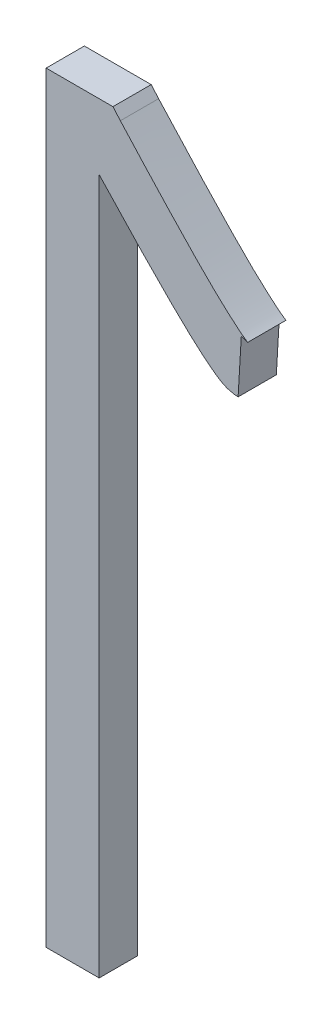
ISO-10303-21;
HEADER;
FILE_DESCRIPTION(('STEP AP214'),'2;1');
FILE_NAME('part.step','',(''),(''),'','','');
FILE_SCHEMA(('AUTOMOTIVE_DESIGN { 1 0 10303 214 1 1 1 1 }'));
ENDSEC;
DATA;
#1=APPLICATION_CONTEXT('core data for automotive mechanical design processes');
#2=APPLICATION_PROTOCOL_DEFINITION('international standard','automotive_design',2000,#1);
#3=PRODUCT_CONTEXT('',#1,'mechanical');
#4=PRODUCT('Part','Part','',(#3));
#5=PRODUCT_RELATED_PRODUCT_CATEGORY('part','',(#4));
#6=PRODUCT_DEFINITION_FORMATION('','',#4);
#7=PRODUCT_DEFINITION_CONTEXT('part definition',#1,'design');
#8=PRODUCT_DEFINITION('design','',#6,#7);
#9=PRODUCT_DEFINITION_SHAPE('','',#8);
#10=(LENGTH_UNIT() NAMED_UNIT(*) SI_UNIT(.MILLI.,.METRE.));
#11=(NAMED_UNIT(*) PLANE_ANGLE_UNIT() SI_UNIT($,.RADIAN.));
#12=(NAMED_UNIT(*) SI_UNIT($,.STERADIAN.) SOLID_ANGLE_UNIT());
#13=UNCERTAINTY_MEASURE_WITH_UNIT(LENGTH_MEASURE(1.E-05),#10,'distance_accuracy_value','');
#14=(GEOMETRIC_REPRESENTATION_CONTEXT(3) GLOBAL_UNCERTAINTY_ASSIGNED_CONTEXT((#13)) GLOBAL_UNIT_ASSIGNED_CONTEXT((#10,
#11,#12)) REPRESENTATION_CONTEXT('',''));
#15=CARTESIAN_POINT('',(0.,0.,0.));
#16=DIRECTION('',(0.,0.,1.));
#17=DIRECTION('',(1.,0.,0.));
#18=AXIS2_PLACEMENT_3D('',#15,#16,#17);
#19=CARTESIAN_POINT('',(68.447564492184,63.9182003094345,-39.));
#20=DIRECTION('',(-4.75972443378902E-11,-4.42735276274626E-11,-1.));
#21=DIRECTION('',(-1.,0.,4.75972443378902E-11));
#22=AXIS2_PLACEMENT_3D('',#19,#20,#21);
#23=PLANE('',#22);
#24=DIRECTION('',(-1.,0.,4.75972443378902E-11));
#25=VECTOR('',#24,1.);
#26=CARTESIAN_POINT('',(68.447564492184,62.2764032970511,-38.9999999999273));
#27=LINE('',#26,#25);
#28=CARTESIAN_POINT('',(68.2779789419903,62.2764032970511,-38.9999999999731));
#29=VERTEX_POINT('',#28);
#30=CARTESIAN_POINT('',(68.1392826867903,62.2764032970511,-38.9999999999709));
#31=VERTEX_POINT('',#30);
#32=EDGE_CURVE('E154',#29,#31,#27,.T.);
#33=ORIENTED_EDGE('',*,*,#32,.F.);
#34=DIRECTION('',(0.,1.,0.));
#35=VECTOR('',#34,1.);
#36=CARTESIAN_POINT('',(68.2779789419903,62.2764032970511,-39.));
#37=LINE('',#36,#35);
#38=CARTESIAN_POINT('',(68.2779789419903,64.0960981652811,-39.));
#39=VERTEX_POINT('',#38);
#40=EDGE_CURVE('E146',#29,#39,#37,.T.);
#41=ORIENTED_EDGE('',*,*,#40,.T.);
#42=CARTESIAN_POINT('',(68.2779789419903,64.0960981652811,-39.0000000000001));
#43=CARTESIAN_POINT('',(68.3006555803954,64.0717416984526,-39.));
#44=CARTESIAN_POINT('',(68.323361418548,64.0474068496181,-38.9999999999999));
#45=CARTESIAN_POINT('',(68.3691170207775,63.9989135358869,-38.9999999999998));
#46=CARTESIAN_POINT('',(68.3921676635081,63.9747559025107,-38.9999999999999));
#47=CARTESIAN_POINT('',(68.4319952873825,63.9338523174141,-39.0000000000002));
#48=CARTESIAN_POINT('',(68.448652051331,63.9169895837439,-39.0000000000005));
#49=CARTESIAN_POINT('',(68.4823322613997,63.8836942824924,-38.9999999999997));
#50=CARTESIAN_POINT('',(68.4993549233173,63.8672609352874,-38.9999999999986));
#51=CARTESIAN_POINT('',(68.5253676463016,63.8432865930499,-39.0000000000002));
#52=CARTESIAN_POINT('',(68.5340771251958,63.8354423767731,-39.0000000000013));
#53=CARTESIAN_POINT('',(68.5518641100801,63.820105391124,-38.9999999999998));
#54=CARTESIAN_POINT('',(68.5609428331864,63.8126139954323,-38.9999999999972));
#55=CARTESIAN_POINT('',(68.573023435901,63.8033615870462,-38.9999999999997));
#56=CARTESIAN_POINT('',(68.575788159778,63.8012905192992,-39.0000000000007));
#57=CARTESIAN_POINT('',(68.5813652496185,63.7972140263459,-39.0000000000013));
#58=CARTESIAN_POINT('',(68.5841776046496,63.7952085863784,-39.0000000000009));
#59=CARTESIAN_POINT('',(68.5898866851449,63.7913472296511,-39.0000000000013));
#60=CARTESIAN_POINT('',(68.5927829863049,63.7894906954745,-39.0000000000021));
#61=CARTESIAN_POINT('',(68.5986999189575,63.7860002510019,-39.0000000000005));
#62=CARTESIAN_POINT('',(68.601720204891,63.7843657702789,-38.9999999999981));
#63=CARTESIAN_POINT('',(68.6070280748129,63.7818721562172,-38.9999999999988));
#64=CARTESIAN_POINT('',(68.6092733955999,63.7809257580502,-39.0000000000005));
#65=CARTESIAN_POINT('',(68.6138585396111,63.7792886587211,-39.0000000000029));
#66=CARTESIAN_POINT('',(68.6161985001896,63.7785983451566,-39.0000000000037));
#67=CARTESIAN_POINT('',(68.6209112388837,63.7773603238648,-39.0000000000002));
#68=CARTESIAN_POINT('',(68.6232840052924,63.7768125665822,-38.9999999999961));
#69=CARTESIAN_POINT('',(68.6280474213865,63.775801218121,-39.0000000000083));
#70=CARTESIAN_POINT('',(68.6304380562402,63.775337563798,-39.0000000000247));
#71=CARTESIAN_POINT('',(68.6342581603601,63.7747844344083,-39.0000000000188));
#72=CARTESIAN_POINT('',(68.635675922297,63.7746195165295,-39.0000000000097));
#73=CARTESIAN_POINT('',(68.6385162673154,63.7743905422371,-38.9999999999957));
#74=CARTESIAN_POINT('',(68.6399388336155,63.7743262710002,-38.9999999999908));
#75=CARTESIAN_POINT('',(68.6413631305903,63.7743228532211,-38.9999999999972));
#76=B_SPLINE_CURVE_WITH_KNOTS('',3,(#42,#43,#44,#45,#46,#47,#48,#49,#50,#51,#52,#53,#54,#55,#56,
#57,#58,#59,#60,#61,#62,#63,#64,#65,#66,#67,#68,#69,#70,#71,#72,#73,#74,#75),.UNSPECIFIED.,.F.,
.F.,(4,2,2,2,2,2,2,2,2,2,2,2,2,2,2,2,4),(0.,0.0998428695418381,0.200010597139852,
0.271115291433883,0.342080370866229,0.377240330425396,0.412527452680904,0.422890123262118,
0.433250446791859,0.44356531528265,0.453853163834976,0.461150074505124,0.468457984804843,
0.4757633513255,0.4830632100746,0.487341754579303,0.491611154323266),.UNSPECIFIED.);
#77=CARTESIAN_POINT('',(68.6413631305874,63.7743228532213,-38.9999999999993));
#78=VERTEX_POINT('',#77);
#79=EDGE_CURVE('E221',#39,#78,#76,.T.);
#80=ORIENTED_EDGE('',*,*,#79,.T.);
#81=DIRECTION('',(-0.0587220219514129,-0.998274373174999,0.));
#82=VECTOR('',#81,1.);
#83=CARTESIAN_POINT('',(68.6413631305786,63.7743228532218,-39.));
#84=LINE('',#83,#82);
#85=CARTESIAN_POINT('',(68.6496849058937,63.9157930335311,-39.));
#86=VERTEX_POINT('',#85);
#87=EDGE_CURVE('E160',#78,#86,#84,.F.);
#88=ORIENTED_EDGE('',*,*,#87,.T.);
#89=DIRECTION('',(-0.948683298050771,0.316227766016067,0.));
#90=VECTOR('',#89,1.);
#91=CARTESIAN_POINT('',(68.6496849059003,63.9157930335511,-39.));
#92=LINE('',#91,#90);
#93=CARTESIAN_POINT('',(68.6663284565903,63.9102451833211,-39.000000000005));
#94=VERTEX_POINT('',#93);
#95=EDGE_CURVE('E95',#86,#94,#92,.F.);
#96=ORIENTED_EDGE('',*,*,#95,.T.);
#97=CARTESIAN_POINT('',(68.6663284565903,63.9102451833211,-39.0000000000101));
#98=CARTESIAN_POINT('',(68.6631666264046,63.912263360773,-39.00000000001));
#99=CARTESIAN_POINT('',(68.6600817551967,63.9143937950362,-39.0000000000099));
#100=CARTESIAN_POINT('',(68.6540328520289,63.9188129149278,-39.0000000000099));
#101=CARTESIAN_POINT('',(68.6510686683829,63.9211013915071,-39.0000000000098));
#102=CARTESIAN_POINT('',(68.6452220310909,63.9257743150047,-39.0000000000097));
#103=CARTESIAN_POINT('',(68.6423395232721,63.9281586956474,-39.0000000000097));
#104=CARTESIAN_POINT('',(68.6366031990929,63.9329636284872,-39.0000000000096));
#105=CARTESIAN_POINT('',(68.6337493934814,63.9353841934491,-39.0000000000096));
#106=CARTESIAN_POINT('',(68.6252360298289,63.9426779778371,-39.0000000000096));
#107=CARTESIAN_POINT('',(68.6196123876417,63.9475932755509,-39.0000000000096));
#108=CARTESIAN_POINT('',(68.6084654669413,63.9575390878733,-39.0000000000093));
#109=CARTESIAN_POINT('',(68.6029422149863,63.9625696321971,-39.0000000000089));
#110=CARTESIAN_POINT('',(68.5865321982889,63.9777937598469,-39.0000000000102));
#111=CARTESIAN_POINT('',(68.5757846698538,63.9881375052907,-39.0000000000144));
#112=CARTESIAN_POINT('',(68.5545666351993,64.0091023198122,-39.0000000000039));
#113=CARTESIAN_POINT('',(68.5440961270125,64.0197233869193,-38.9999999999891));
#114=CARTESIAN_POINT('',(68.525158731474,64.0391993463719,-38.9999999999924));
#115=CARTESIAN_POINT('',(68.5166678421672,64.0480310542963,-39.000000000005));
#116=CARTESIAN_POINT('',(68.4997370163756,64.0657428752237,-39.000000000013));
#117=CARTESIAN_POINT('',(68.4912970790388,64.0746229874126,-39.0000000000083));
#118=CARTESIAN_POINT('',(68.466048604975,64.1013504543014,-39.0000000000104));
#119=CARTESIAN_POINT('',(68.4493214066294,64.1192746076717,-39.0000000000333));
#120=CARTESIAN_POINT('',(68.4243164716795,64.1462482850813,-39.0000000000234));
#121=CARTESIAN_POINT('',(68.4159937713975,64.1552563073521,-39.0000000000127));
#122=CARTESIAN_POINT('',(68.3994027484361,64.1733224120815,-39.0000000000053));
#123=CARTESIAN_POINT('',(68.391134426124,64.1823804948773,-39.0000000000084));
#124=CARTESIAN_POINT('',(68.3787384737149,64.1959669617419,-39.0000000000093));
#125=CARTESIAN_POINT('',(68.3746092161347,64.2004938773921,-39.000000000009));
#126=CARTESIAN_POINT('',(68.3663361811171,64.2095343212935,-39.0000000000091));
#127=CARTESIAN_POINT('',(68.3621924037962,64.2140478496517,-39.0000000000095));
#128=CARTESIAN_POINT('',(68.353916670893,64.2230859998577,-39.0000000000086));
#129=CARTESIAN_POINT('',(68.3497847154686,64.2276106218523,-39.0000000000073));
#130=CARTESIAN_POINT('',(68.3415723988403,64.236706526035,-39.0000000000108));
#131=CARTESIAN_POINT('',(68.3374920389764,64.2412778094293,-39.0000000000156));
#132=CARTESIAN_POINT('',(68.3334574440903,64.2458901209011,-39.0000000000272));
#133=B_SPLINE_CURVE_WITH_KNOTS('',3,(#97,#98,#99,#100,#101,#102,#103,#104,#105,#106,#107,#108,
#109,#110,#111,#112,#113,#114,#115,#116,#117,#118,#119,#120,#121,#122,#123,#124,#125,#126,#127,
#128,#129,#130,#131,#132),.UNSPECIFIED.,.F.,.F.,(4,2,2,2,2,2,2,2,2,2,2,2,2,2,2,2,2,4),(0.,
0.01124434568953,0.0224740928101984,0.0336962084844143,0.0449223810029845,0.0673275766513838,
0.0897386157500265,0.134479554821638,0.179220176066574,0.215973811907436,0.252726831512014,
0.326276003969627,0.363068657346945,0.399861558912346,0.41824342005346,0.436625133971727,
0.455007092306981,0.473389526996567),.UNSPECIFIED.);
#134=CARTESIAN_POINT('',(68.3334574440799,64.245890120892,-39.0000000000113));
#135=VERTEX_POINT('',#134);
#136=EDGE_CURVE('E24',#94,#135,#133,.T.);
#137=ORIENTED_EDGE('',*,*,#136,.T.);
#138=DIRECTION('',(0.658504607868102,-0.752576694707242,0.));
#139=VECTOR('',#138,1.);
#140=CARTESIAN_POINT('',(68.3334574440485,64.2458901208646,-39.));
#141=LINE('',#140,#139);
#142=CARTESIAN_POINT('',(68.3140399682903,64.2680815217311,-39.));
#143=VERTEX_POINT('',#142);
#144=EDGE_CURVE('E98',#135,#143,#141,.F.);
#145=ORIENTED_EDGE('',*,*,#144,.T.);
#146=DIRECTION('',(1.,0.,0.));
#147=VECTOR('',#146,1.);
#148=CARTESIAN_POINT('',(68.3140399682903,64.2680815217311,-39.));
#149=LINE('',#148,#147);
#150=CARTESIAN_POINT('',(68.1392826867903,64.2680815217311,-39.));
#151=VERTEX_POINT('',#150);
#152=EDGE_CURVE('E133',#143,#151,#149,.F.);
#153=ORIENTED_EDGE('',*,*,#152,.T.);
#154=DIRECTION('',(0.,1.,0.));
#155=VECTOR('',#154,1.);
#156=CARTESIAN_POINT('',(68.1392826867903,64.2680815217311,-39.));
#157=LINE('',#156,#155);
#158=EDGE_CURVE('E151',#151,#31,#157,.F.);
#159=ORIENTED_EDGE('',*,*,#158,.T.);
#160=EDGE_LOOP('',(#33,#41,#80,#88,#96,#137,#145,#153,#159));
#161=FACE_BOUND('',#160,.T.);
#162=ADVANCED_FACE('F17',(#161),#23,.F.);
#163=CARTESIAN_POINT('',(68.1392826867903,64.2680815217311,-39.));
#164=DIRECTION('',(1.,0.,0.));
#165=DIRECTION('',(0.,0.,-1.));
#166=AXIS2_PLACEMENT_3D('',#163,#164,#165);
#167=PLANE('',#166);
#168=DIRECTION('',(0.,0.,1.));
#169=VECTOR('',#168,1.);
#170=CARTESIAN_POINT('',(68.1392826867903,62.2764032970511,-39.));
#171=LINE('',#170,#169);
#172=CARTESIAN_POINT('',(68.1392826867903,62.2764032970511,-39.0999999999126));
#173=VERTEX_POINT('',#172);
#174=EDGE_CURVE('E140',#173,#31,#171,.T.);
#175=ORIENTED_EDGE('',*,*,#174,.T.);
#176=ORIENTED_EDGE('',*,*,#158,.F.);
#177=DIRECTION('',(0.,0.,-1.));
#178=VECTOR('',#177,1.);
#179=CARTESIAN_POINT('',(68.1392826867903,64.2680815217311,-39.));
#180=LINE('',#179,#178);
#181=CARTESIAN_POINT('',(68.1392826867903,64.2680815217311,-39.1000000000008));
#182=VERTEX_POINT('',#181);
#183=EDGE_CURVE('E110',#151,#182,#180,.T.);
#184=ORIENTED_EDGE('',*,*,#183,.T.);
#185=DIRECTION('',(0.,1.,-4.42735276274626E-11));
#186=VECTOR('',#185,1.);
#187=CARTESIAN_POINT('',(68.1392826867903,63.9182003094345,-39.0999999999853));
#188=LINE('',#187,#186);
#189=EDGE_CURVE('E129',#173,#182,#188,.T.);
#190=ORIENTED_EDGE('',*,*,#189,.F.);
#191=EDGE_LOOP('',(#175,#176,#184,#190));
#192=FACE_BOUND('',#191,.T.);
#193=ADVANCED_FACE('F211',(#192),#167,.F.);
#194=CARTESIAN_POINT('',(68.3140399682903,64.2680815217311,-39.));
#195=DIRECTION('',(0.,-1.,0.));
#196=DIRECTION('',(0.,0.,-1.));
#197=AXIS2_PLACEMENT_3D('',#194,#195,#196);
#198=PLANE('',#197);
#199=ORIENTED_EDGE('',*,*,#183,.F.);
#200=ORIENTED_EDGE('',*,*,#152,.F.);
#201=DIRECTION('',(0.,0.,1.));
#202=VECTOR('',#201,1.);
#203=CARTESIAN_POINT('',(68.3140399682903,64.2680815217311,-39.));
#204=LINE('',#203,#202);
#205=CARTESIAN_POINT('',(68.3140399682903,64.2680815217311,-39.1000000000091));
#206=VERTEX_POINT('',#205);
#207=EDGE_CURVE('E104',#143,#206,#204,.F.);
#208=ORIENTED_EDGE('',*,*,#207,.T.);
#209=DIRECTION('',(-1.,0.,4.75972443378902E-11));
#210=VECTOR('',#209,1.);
#211=CARTESIAN_POINT('',(68.447564492184,64.2680815217311,-39.1000000000155));
#212=LINE('',#211,#210);
#213=EDGE_CURVE('E125',#182,#206,#212,.F.);
#214=ORIENTED_EDGE('',*,*,#213,.F.);
#215=EDGE_LOOP('',(#199,#200,#208,#214));
#216=FACE_BOUND('',#215,.T.);
#217=ADVANCED_FACE('F208',(#216),#198,.F.);
#218=CARTESIAN_POINT('',(68.3334574440485,64.2458901208646,-39.));
#219=DIRECTION('',(-0.752576694707242,-0.658504607868102,0.));
#220=DIRECTION('',(0.658504607868102,-0.752576694707242,0.));
#221=AXIS2_PLACEMENT_3D('',#218,#219,#220);
#222=PLANE('',#221);
#223=ORIENTED_EDGE('',*,*,#207,.F.);
#224=ORIENTED_EDGE('',*,*,#144,.F.);
#225=DIRECTION('',(0.,0.,-1.));
#226=VECTOR('',#225,1.);
#227=CARTESIAN_POINT('',(68.3334574440903,64.2458901209011,-39.05));
#228=LINE('',#227,#226);
#229=CARTESIAN_POINT('',(68.3334574440903,64.2458901209011,-39.1000000000159));
#230=VERTEX_POINT('',#229);
#231=EDGE_CURVE('E103',#135,#230,#228,.T.);
#232=ORIENTED_EDGE('',*,*,#231,.T.);
#233=DIRECTION('',(0.658504609285161,-0.752576693467315,1.88254896408836E-12));
#234=VECTOR('',#233,1.);
#235=CARTESIAN_POINT('',(68.3140399682903,64.2680815217311,-39.1000000000091));
#236=LINE('',#235,#234);
#237=EDGE_CURVE('E128',#206,#230,#236,.T.);
#238=ORIENTED_EDGE('',*,*,#237,.F.);
#239=EDGE_LOOP('',(#223,#224,#232,#238));
#240=FACE_BOUND('',#239,.T.);
#241=ADVANCED_FACE('F107',(#240),#222,.F.);
#242=CARTESIAN_POINT('',(68.6663284565903,63.9102451833211,-39.));
#243=CARTESIAN_POINT('',(68.6663284565903,63.9102451833211,-39.1));
#244=CARTESIAN_POINT('',(68.6623090070903,63.9128106150712,-39.));
#245=CARTESIAN_POINT('',(68.6623090070903,63.9128106150712,-39.1));
#246=CARTESIAN_POINT('',(68.6525978408903,63.9196598710911,-39.));
#247=CARTESIAN_POINT('',(68.6525978408903,63.9196598710911,-39.1));
#248=CARTESIAN_POINT('',(68.6360874510903,63.9332862315011,-39.));
#249=CARTESIAN_POINT('',(68.6360874510903,63.9332862315011,-39.1));
#250=CARTESIAN_POINT('',(68.6149255722903,63.9515757994111,-39.));
#251=CARTESIAN_POINT('',(68.6149255722903,63.9515757994111,-39.1));
#252=CARTESIAN_POINT('',(68.5902165865903,63.9741962100811,-39.));
#253=CARTESIAN_POINT('',(68.5902165865903,63.9741962100811,-39.1));
#254=CARTESIAN_POINT('',(68.5629658677903,64.0005919824511,-39.));
#255=CARTESIAN_POINT('',(68.5629658677903,64.0005919824511,-39.1));
#256=CARTESIAN_POINT('',(68.5337347365903,64.0302387905511,-39.));
#257=CARTESIAN_POINT('',(68.5337347365903,64.0302387905511,-39.1));
#258=CARTESIAN_POINT('',(68.5026423796903,64.0626383132811,-39.));
#259=CARTESIAN_POINT('',(68.5026423796903,64.0626383132811,-39.1));
#260=CARTESIAN_POINT('',(68.4698109029903,64.0973079919511,-39.));
#261=CARTESIAN_POINT('',(68.4698109029903,64.0973079919511,-39.1));
#262=CARTESIAN_POINT('',(68.4358401407903,64.1337628938011,-39.));
#263=CARTESIAN_POINT('',(68.4358401407903,64.1337628938011,-39.1));
#264=CARTESIAN_POINT('',(68.4013583721903,64.1710978473811,-39.));
#265=CARTESIAN_POINT('',(68.4013583721903,64.1710978473811,-39.1));
#266=CARTESIAN_POINT('',(68.3672479230903,64.2086364377211,-39.));
#267=CARTESIAN_POINT('',(68.3672479230903,64.2086364377211,-39.1));
#268=CARTESIAN_POINT('',(68.3444500846903,64.2333271030511,-39.));
#269=CARTESIAN_POINT('',(68.3444500846903,64.2333271030511,-39.1));
#270=CARTESIAN_POINT('',(68.3334574440903,64.2458901209011,-39.));
#271=CARTESIAN_POINT('',(68.3334574440903,64.2458901209011,-39.1));
#272=B_SPLINE_SURFACE_WITH_KNOTS('',3,1,((#242,#243),(#244,#245),(#246,#247),(#248,#249),(#250,
#251),(#252,#253),(#254,#255),(#256,#257),(#258,#259),(#260,#261),(#262,#263),(#264,#265),(#266,
#267),(#268,#269),(#270,#271)),.UNSPECIFIED.,.F.,.F.,.F.,(4,1,1,1,1,1,1,1,1,1,1,1,4),(2,2),(0.,
0.0301632298913,0.0753104703666,0.1355499087429,0.2074424892077,0.2875616665251,0.3759570962285,
0.4712749173558,0.5721374197463,0.6785504860529,0.7870597152265,0.894208704653,1.),(1.,1.1),.UNSPECIFIED.);
#273=DIRECTION('',(0.,0.,1.));
#274=VECTOR('',#273,1.);
#275=CARTESIAN_POINT('',(68.6663284565903,63.9102451833211,-39.));
#276=LINE('',#275,#274);
#277=CARTESIAN_POINT('',(68.6663284565903,63.9102451833211,-39.1000000000101));
#278=VERTEX_POINT('',#277);
#279=EDGE_CURVE('E117',#94,#278,#276,.F.);
#280=CARTESIAN_POINT('',(68.3334574440903,64.2458901209011,-39.0999999999955));
#281=CARTESIAN_POINT('',(68.3389424310075,64.2396214656324,-39.1000000000042));
#282=CARTESIAN_POINT('',(68.3445098722922,64.2334274179446,-39.1000000000078));
#283=CARTESIAN_POINT('',(68.3557150954348,64.2211030082827,-39.1000000000103));
#284=CARTESIAN_POINT('',(68.3613528769174,64.2149726459689,-39.1000000000094));
#285=CARTESIAN_POINT('',(68.3726042293612,64.2026900600058,-39.1000000000087));
#286=CARTESIAN_POINT('',(68.3782178005093,64.1965378365257,-39.100000000009));
#287=CARTESIAN_POINT('',(68.3894443113695,64.1842327006801,-39.1000000000091));
#288=CARTESIAN_POINT('',(68.3950572510789,64.1780797883116,-39.1000000000088));
#289=CARTESIAN_POINT('',(68.411952499477,64.1596324695832,-39.1000000000093));
#290=CARTESIAN_POINT('',(68.4232713403289,64.1473715542868,-39.1000000000112));
#291=CARTESIAN_POINT('',(68.4459642196372,64.1229008717801,-39.1000000000068));
#292=CARTESIAN_POINT('',(68.457338257926,64.1106911044147,-39.1000000000004));
#293=CARTESIAN_POINT('',(68.4843086593115,64.081958410916,-39.0999999999994));
#294=CARTESIAN_POINT('',(68.4999443733308,64.06547259375,-39.1000000000098));
#295=CARTESIAN_POINT('',(68.5313974530526,64.0327012943394,-39.1000000000083));
#296=CARTESIAN_POINT('',(68.5472146316537,64.0164156363185,-39.0999999999966));
#297=CARTESIAN_POINT('',(68.571441568621,63.9924084429978,-39.1000000000017));
#298=CARTESIAN_POINT('',(68.5796217909697,63.9844569460074,-39.1000000000073));
#299=CARTESIAN_POINT('',(68.5961843107614,63.9687713627149,-39.1000000000113));
#300=CARTESIAN_POINT('',(68.6045665477284,63.9610372128124,-39.1000000000097));
#301=CARTESIAN_POINT('',(68.617327005904,63.9496245242543,-39.1000000000093));
#302=CARTESIAN_POINT('',(68.6216168914208,63.945847336281,-39.1000000000095));
#303=CARTESIAN_POINT('',(68.6302515479803,63.938360163604,-39.1000000000096));
#304=CARTESIAN_POINT('',(68.634596302229,63.9346501591446,-39.1000000000096));
#305=CARTESIAN_POINT('',(68.6433586890212,63.9273007912788,-39.1000000000097));
#306=CARTESIAN_POINT('',(68.6477764031912,63.9236615185311,-39.1000000000098));
#307=CARTESIAN_POINT('',(68.6568415204799,63.9166763698502,-39.1000000000099));
#308=CARTESIAN_POINT('',(68.6614891526549,63.9133307961093,-39.10000000001));
#309=CARTESIAN_POINT('',(68.6663284565903,63.9102451833211,-39.1000000000101));
#310=B_SPLINE_CURVE_WITH_KNOTS('',3,(#280,#281,#282,#283,#284,#285,#286,#287,#288,#289,#290,
#291,#292,#293,#294,#295,#296,#297,#298,#299,#300,#301,#302,#303,#304,#305,#306,#307,#308,#309),
.UNSPECIFIED.,.F.,.F.,(4,2,2,2,2,2,2,2,2,2,2,2,2,2,4),(0.,0.0249855688329285,0.0499710043863429,
0.0749562468902699,0.0999416009353751,0.15000145686577,0.200061160724135,0.268225383486305,
0.336324714485637,0.37054563361864,0.404756432448007,0.421902679750831,0.439043800438855,
0.45620560829012,0.473384872185978),.UNSPECIFIED.);
#311=EDGE_CURVE('E114',#230,#278,#310,.T.);
#312=ORIENTED_EDGE('',*,*,#231,.F.);
#313=ORIENTED_EDGE('',*,*,#136,.F.);
#314=ORIENTED_EDGE('',*,*,#279,.T.);
#315=ORIENTED_EDGE('',*,*,#311,.F.);
#316=EDGE_LOOP('',(#312,#313,#314,#315));
#317=FACE_BOUND('',#316,.T.);
#318=ADVANCED_FACE('F112',(#317),#272,.F.);
#319=CARTESIAN_POINT('',(68.6496849059003,63.9157930335511,-39.));
#320=DIRECTION('',(0.316227766016067,0.948683298050771,0.));
#321=DIRECTION('',(-0.948683298050771,0.316227766016067,0.));
#322=AXIS2_PLACEMENT_3D('',#319,#320,#321);
#323=PLANE('',#322);
#324=ORIENTED_EDGE('',*,*,#279,.F.);
#325=ORIENTED_EDGE('',*,*,#95,.F.);
#326=DIRECTION('',(0.,0.,1.));
#327=VECTOR('',#326,1.);
#328=CARTESIAN_POINT('',(68.6496849058903,63.9157930335211,-39.));
#329=LINE('',#328,#327);
#330=CARTESIAN_POINT('',(68.6496849058903,63.9157930335211,-39.1000000000095));
#331=VERTEX_POINT('',#330);
#332=EDGE_CURVE('E162',#86,#331,#329,.F.);
#333=ORIENTED_EDGE('',*,*,#332,.T.);
#334=DIRECTION('',(-0.948683298620533,0.316227764306779,3.12458691789293E-11));
#335=VECTOR('',#334,1.);
#336=CARTESIAN_POINT('',(68.6663284565903,63.9102451833211,-39.1000000000101));
#337=LINE('',#336,#335);
#338=EDGE_CURVE('E246',#278,#331,#337,.T.);
#339=ORIENTED_EDGE('',*,*,#338,.F.);
#340=EDGE_LOOP('',(#324,#325,#333,#339));
#341=FACE_BOUND('',#340,.T.);
#342=ADVANCED_FACE('F201',(#341),#323,.F.);
#343=CARTESIAN_POINT('',(68.6413631305786,63.7743228532218,-39.));
#344=DIRECTION('',(-0.998274373174999,0.0587220219514129,0.));
#345=DIRECTION('',(-0.0587220219514129,-0.998274373174999,0.));
#346=AXIS2_PLACEMENT_3D('',#343,#344,#345);
#347=PLANE('',#346);
#348=ORIENTED_EDGE('',*,*,#332,.F.);
#349=ORIENTED_EDGE('',*,*,#87,.F.);
#350=DIRECTION('',(0.,0.,-1.));
#351=VECTOR('',#350,1.);
#352=CARTESIAN_POINT('',(68.6413631305903,63.7743228532211,-39.05));
#353=LINE('',#352,#351);
#354=CARTESIAN_POINT('',(68.6413631305903,63.7743228532211,-39.1000000000007));
#355=VERTEX_POINT('',#354);
#356=EDGE_CURVE('E148',#78,#355,#353,.T.);
#357=ORIENTED_EDGE('',*,*,#356,.T.);
#358=DIRECTION('',(-0.0587220218686165,-0.99827437317987,4.70052639353647E-11));
#359=VECTOR('',#358,1.);
#360=CARTESIAN_POINT('',(68.6496849058903,63.9157930335211,-39.1000000000095));
#361=LINE('',#360,#359);
#362=EDGE_CURVE('E180',#331,#355,#361,.T.);
#363=ORIENTED_EDGE('',*,*,#362,.F.);
#364=EDGE_LOOP('',(#348,#349,#357,#363));
#365=FACE_BOUND('',#364,.T.);
#366=ADVANCED_FACE('F198',(#365),#347,.F.);
#367=CARTESIAN_POINT('',(68.2779789419903,64.0960981652811,-39.));
#368=CARTESIAN_POINT('',(68.2779789419903,64.0960981652811,-39.1));
#369=CARTESIAN_POINT('',(68.3003547033903,64.0720426034211,-39.));
#370=CARTESIAN_POINT('',(68.3003547033903,64.0720426034211,-39.1));
#371=CARTESIAN_POINT('',(68.3418154762903,64.0276260016811,-39.));
#372=CARTESIAN_POINT('',(68.3418154762903,64.0276260016811,-39.1));
#373=CARTESIAN_POINT('',(68.3995552323903,63.9670069466511,-39.));
#374=CARTESIAN_POINT('',(68.3995552323903,63.9670069466511,-39.1));
#375=CARTESIAN_POINT('',(68.4483572632903,63.9171172222911,-39.));
#376=CARTESIAN_POINT('',(68.4483572632903,63.9171172222911,-39.1));
#377=CARTESIAN_POINT('',(68.4894922403903,63.8766587639711,-39.));
#378=CARTESIAN_POINT('',(68.4894922403903,63.8766587639711,-39.1));
#379=CARTESIAN_POINT('',(68.5240839016903,63.8441801883311,-39.));
#380=CARTESIAN_POINT('',(68.5240839016903,63.8441801883311,-39.1));
#381=CARTESIAN_POINT('',(68.5530534827903,63.8188351487611,-39.));
#382=CARTESIAN_POINT('',(68.5530534827903,63.8188351487611,-39.1));
#383=CARTESIAN_POINT('',(68.5768571835903,63.8001795507911,-39.));
#384=CARTESIAN_POINT('',(68.5768571835903,63.8001795507911,-39.1));
#385=CARTESIAN_POINT('',(68.5956422796903,63.7872310175111,-39.));
#386=CARTESIAN_POINT('',(68.5956422796903,63.7872310175111,-39.1));
#387=CARTESIAN_POINT('',(68.6107907744903,63.7798839447611,-39.));
#388=CARTESIAN_POINT('',(68.6107907744903,63.7798839447611,-39.1));
#389=CARTESIAN_POINT('',(68.6228913859904,63.7768444113011,-39.));
#390=CARTESIAN_POINT('',(68.6228913859904,63.7768444113011,-39.1));
#391=CARTESIAN_POINT('',(68.6326145866903,63.7748433362411,-39.));
#392=CARTESIAN_POINT('',(68.6326145866903,63.7748433362411,-39.1));
#393=CARTESIAN_POINT('',(68.6386161442903,63.7743288738711,-39.));
#394=CARTESIAN_POINT('',(68.6386161442903,63.7743288738711,-39.1));
#395=CARTESIAN_POINT('',(68.6413631305903,63.7743228532211,-39.));
#396=CARTESIAN_POINT('',(68.6413631305903,63.7743228532211,-39.1));
#397=B_SPLINE_SURFACE_WITH_KNOTS('',3,1,((#367,#368),(#369,#370),(#371,#372),(#373,#374),(#375,
#376),(#377,#378),(#379,#380),(#381,#382),(#383,#384),(#385,#386),(#387,#388),(#389,#390),(#391,
#392),(#393,#394),(#395,#396)),.UNSPECIFIED.,.F.,.F.,.F.,(4,1,1,1,1,1,1,1,1,1,1,1,4),(2,2),(0.,
0.2005042297176,0.370797139124,0.5109018519751,0.626399680036,0.722885479643,0.8004481808713,
0.8612129274333,0.90738303319198,0.93950368706772,0.96323219905349,0.98333749397607,1.),(1.,
1.1),.UNSPECIFIED.);
#398=DIRECTION('',(0.,0.,1.));
#399=VECTOR('',#398,1.);
#400=CARTESIAN_POINT('',(68.2779789419903,64.0960981652811,-39.));
#401=LINE('',#400,#399);
#402=CARTESIAN_POINT('',(68.2779789419903,64.0960981652811,-39.0999999999998));
#403=VERTEX_POINT('',#402);
#404=EDGE_CURVE('E143',#39,#403,#401,.F.);
#405=CARTESIAN_POINT('',(68.6413631305903,63.7743228532211,-39.0999999999986));
#406=CARTESIAN_POINT('',(68.6387200007664,63.774319779758,-39.1000000000013));
#407=CARTESIAN_POINT('',(68.6360988602659,63.7745405892372,-39.1000000000023));
#408=CARTESIAN_POINT('',(68.6308792517897,63.7752571363806,-39.1000000000028));
#409=CARTESIAN_POINT('',(68.6282809399397,63.7757541127675,-39.1000000000023));
#410=CARTESIAN_POINT('',(68.6231911821366,63.7768297431108,-39.1000000000021));
#411=CARTESIAN_POINT('',(68.6206989550563,63.7774053173035,-39.1000000000023));
#412=CARTESIAN_POINT('',(68.615759854591,63.7787241094511,-39.1000000000015));
#413=CARTESIAN_POINT('',(68.6133128915638,63.7794669462294,-39.1000000000005));
#414=CARTESIAN_POINT('',(68.6047570993281,63.7825971907497,-39.0999999999987));
#415=CARTESIAN_POINT('',(68.5989315592242,63.785735402586,-39.1000000000008));
#416=CARTESIAN_POINT('',(68.5876696911456,63.792699790431,-39.1000000000017));
#417=CARTESIAN_POINT('',(68.5822397488134,63.7965347586587,-39.1000000000006));
#418=CARTESIAN_POINT('',(68.5643909654131,63.8097339810867,-39.0999999999986));
#419=CARTESIAN_POINT('',(68.5523532137645,63.8196237893311,-39.1));
#420=CARTESIAN_POINT('',(68.5288321329044,63.8400412272074,-39.100000000001));
#421=CARTESIAN_POINT('',(68.5173496067461,63.8505697337946,-39.1000000000005));
#422=CARTESIAN_POINT('',(68.4833792053962,63.8824934945658,-39.0999999999997));
#423=CARTESIAN_POINT('',(68.4612794951411,63.9043027907388,-39.1));
#424=CARTESIAN_POINT('',(68.425707801212,63.9402707171853,-39.1));
#425=CARTESIAN_POINT('',(68.4120716770674,63.9542714702652,-39.0999999999999));
#426=CARTESIAN_POINT('',(68.3849353539987,63.9824118104602,-39.0999999999998));
#427=CARTESIAN_POINT('',(68.3714351898966,63.9965514313981,-39.0999999999998));
#428=CARTESIAN_POINT('',(68.3445713272371,64.0248943944317,-39.0999999999998));
#429=CARTESIAN_POINT('',(68.3312073776901,64.0390974998762,-39.0999999999998));
#430=CARTESIAN_POINT('',(68.3045502838962,64.0675618843584,-39.0999999999998));
#431=CARTESIAN_POINT('',(68.2912571192003,64.0818231442289,-39.0999999999999));
#432=CARTESIAN_POINT('',(68.2779789419903,64.0960981652811,-39.1));
#433=B_SPLINE_CURVE_WITH_KNOTS('',3,(#405,#406,#407,#408,#409,#410,#411,#412,#413,#414,#415,
#416,#417,#418,#419,#420,#421,#422,#423,#424,#425,#426,#427,#428,#429,#430,#431,#432),
.UNSPECIFIED.,.F.,.F.,(4,2,2,2,2,2,2,2,2,2,2,2,2,4),(0.,0.00788918398769893,0.0158140432309045,
0.0234883023157149,0.0311452463326072,0.0508253054848078,0.0707735474806593,0.117442432154492,
0.164176912543218,0.257295522095943,0.315928121279451,0.374575373911036,0.433080860556887,
0.491568412808117),.UNSPECIFIED.);
#434=EDGE_CURVE('E172',#355,#403,#433,.T.);
#435=ORIENTED_EDGE('',*,*,#356,.F.);
#436=ORIENTED_EDGE('',*,*,#79,.F.);
#437=ORIENTED_EDGE('',*,*,#404,.T.);
#438=ORIENTED_EDGE('',*,*,#434,.F.);
#439=EDGE_LOOP('',(#435,#436,#437,#438));
#440=FACE_BOUND('',#439,.T.);
#441=ADVANCED_FACE('F19',(#440),#397,.F.);
#442=CARTESIAN_POINT('',(68.2779789419903,62.2764032970511,-39.));
#443=DIRECTION('',(-1.,0.,0.));
#444=DIRECTION('',(0.,0.,1.));
#445=AXIS2_PLACEMENT_3D('',#442,#443,#444);
#446=PLANE('',#445);
#447=ORIENTED_EDGE('',*,*,#404,.F.);
#448=ORIENTED_EDGE('',*,*,#40,.F.);
#449=DIRECTION('',(0.,0.,1.));
#450=VECTOR('',#449,1.);
#451=CARTESIAN_POINT('',(68.2779789419903,62.2764032970511,-39.));
#452=LINE('',#451,#450);
#453=CARTESIAN_POINT('',(68.2779789419903,62.2764032970511,-39.0999999999192));
#454=VERTEX_POINT('',#453);
#455=EDGE_CURVE('E44',#29,#454,#452,.F.);
#456=ORIENTED_EDGE('',*,*,#455,.T.);
#457=DIRECTION('',(0.,1.,-4.42735276274626E-11));
#458=VECTOR('',#457,1.);
#459=CARTESIAN_POINT('',(68.2779789419903,63.9182003094345,-39.0999999999919));
#460=LINE('',#459,#458);
#461=EDGE_CURVE('E35',#403,#454,#460,.F.);
#462=ORIENTED_EDGE('',*,*,#461,.F.);
#463=EDGE_LOOP('',(#447,#448,#456,#462));
#464=FACE_BOUND('',#463,.T.);
#465=ADVANCED_FACE('F194',(#464),#446,.F.);
#466=CARTESIAN_POINT('',(68.1392826867903,62.2764032970511,-39.));
#467=DIRECTION('',(0.,1.,0.));
#468=DIRECTION('',(0.,0.,1.));
#469=AXIS2_PLACEMENT_3D('',#466,#467,#468);
#470=PLANE('',#469);
#471=ORIENTED_EDGE('',*,*,#455,.F.);
#472=ORIENTED_EDGE('',*,*,#32,.T.);
#473=ORIENTED_EDGE('',*,*,#174,.F.);
#474=DIRECTION('',(-1.,0.,4.75972443378902E-11));
#475=VECTOR('',#474,1.);
#476=CARTESIAN_POINT('',(68.447564492184,62.2764032970511,-39.0999999999273));
#477=LINE('',#476,#475);
#478=EDGE_CURVE('E11',#454,#173,#477,.T.);
#479=ORIENTED_EDGE('',*,*,#478,.F.);
#480=EDGE_LOOP('',(#471,#472,#473,#479));
#481=FACE_BOUND('',#480,.T.);
#482=ADVANCED_FACE('F189',(#481),#470,.F.);
#483=CARTESIAN_POINT('',(68.447564492184,63.9182003094345,-39.1));
#484=DIRECTION('',(-4.75972443378902E-11,-4.42735276274626E-11,-1.));
#485=DIRECTION('',(-1.,0.,4.75972443378902E-11));
#486=AXIS2_PLACEMENT_3D('',#483,#484,#485);
#487=PLANE('',#486);
#488=ORIENTED_EDGE('',*,*,#461,.T.);
#489=ORIENTED_EDGE('',*,*,#478,.T.);
#490=ORIENTED_EDGE('',*,*,#189,.T.);
#491=ORIENTED_EDGE('',*,*,#213,.T.);
#492=ORIENTED_EDGE('',*,*,#237,.T.);
#493=ORIENTED_EDGE('',*,*,#311,.T.);
#494=ORIENTED_EDGE('',*,*,#338,.T.);
#495=ORIENTED_EDGE('',*,*,#362,.T.);
#496=ORIENTED_EDGE('',*,*,#434,.T.);
#497=EDGE_LOOP('',(#488,#489,#490,#491,#492,#493,#494,#495,#496));
#498=FACE_BOUND('',#497,.T.);
#499=ADVANCED_FACE('F185',(#498),#487,.T.);
#500=CLOSED_SHELL('',(#162,#193,#217,#241,#318,#342,#366,#441,#465,#482,#499));
#501=MANIFOLD_SOLID_BREP('B1',#500);
#502=ADVANCED_BREP_SHAPE_REPRESENTATION('',(#18,#501),#14);
#503=SHAPE_DEFINITION_REPRESENTATION(#9,#502);
ENDSEC;
END-ISO-10303-21;
